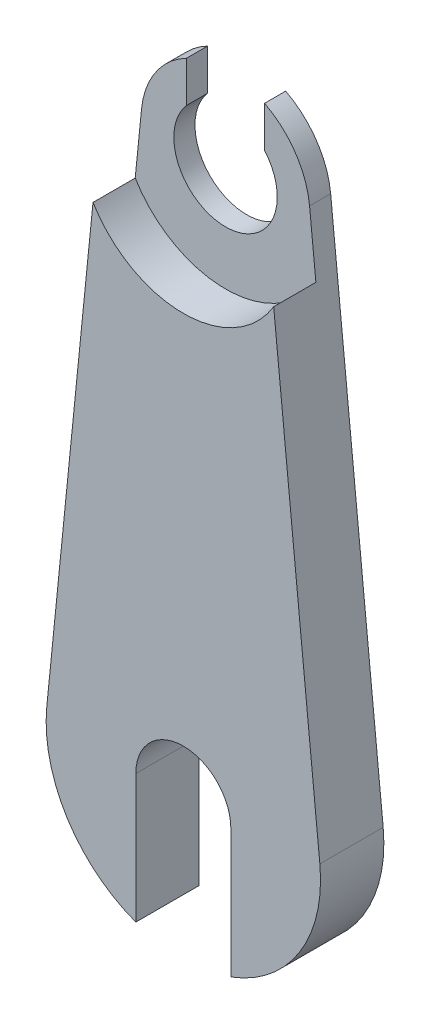
ISO-10303-21;
HEADER;
FILE_DESCRIPTION(('STEP AP214'),'2;1');
FILE_NAME('part.step','',(''),(''),'','','');
FILE_SCHEMA(('AUTOMOTIVE_DESIGN { 1 0 10303 214 1 1 1 1 }'));
ENDSEC;
DATA;
#1=APPLICATION_CONTEXT('core data for automotive mechanical design processes');
#2=APPLICATION_PROTOCOL_DEFINITION('international standard','automotive_design',2000,#1);
#3=PRODUCT_CONTEXT('',#1,'mechanical');
#4=PRODUCT('Part','Part','',(#3));
#5=PRODUCT_RELATED_PRODUCT_CATEGORY('part','',(#4));
#6=PRODUCT_DEFINITION_FORMATION('','',#4);
#7=PRODUCT_DEFINITION_CONTEXT('part definition',#1,'design');
#8=PRODUCT_DEFINITION('design','',#6,#7);
#9=PRODUCT_DEFINITION_SHAPE('','',#8);
#10=(LENGTH_UNIT() NAMED_UNIT(*) SI_UNIT(.MILLI.,.METRE.));
#11=(NAMED_UNIT(*) PLANE_ANGLE_UNIT() SI_UNIT($,.RADIAN.));
#12=(NAMED_UNIT(*) SI_UNIT($,.STERADIAN.) SOLID_ANGLE_UNIT());
#13=UNCERTAINTY_MEASURE_WITH_UNIT(LENGTH_MEASURE(1.E-05),#10,'distance_accuracy_value','');
#14=(GEOMETRIC_REPRESENTATION_CONTEXT(3) GLOBAL_UNCERTAINTY_ASSIGNED_CONTEXT((#13)) GLOBAL_UNIT_ASSIGNED_CONTEXT((#10,
#11,#12)) REPRESENTATION_CONTEXT('',''));
#15=CARTESIAN_POINT('',(0.,0.,0.));
#16=DIRECTION('',(0.,0.,1.));
#17=DIRECTION('',(1.,0.,0.));
#18=AXIS2_PLACEMENT_3D('',#15,#16,#17);
#19=CARTESIAN_POINT('',(0.,-25.,1.));
#20=DIRECTION('',(0.,0.,-1.));
#21=DIRECTION('',(-1.,0.,0.));
#22=AXIS2_PLACEMENT_3D('',#19,#20,#21);
#23=CYLINDRICAL_SURFACE('',#22,6.5);
#24=CARTESIAN_POINT('',(0.,-25.,3.));
#25=DIRECTION('',(0.,0.,1.));
#26=DIRECTION('',(1.,0.,0.));
#27=AXIS2_PLACEMENT_3D('',#24,#25,#26);
#28=CIRCLE('',#27,6.5);
#29=CARTESIAN_POINT('',(2.25000000000001,-31.0981554588252,3.));
#30=VERTEX_POINT('',#29);
#31=CARTESIAN_POINT('',(6.46741834119303,-24.35,3.));
#32=VERTEX_POINT('',#31);
#33=EDGE_CURVE('E173',#30,#32,#28,.T.);
#34=ORIENTED_EDGE('',*,*,#33,.F.);
#35=DIRECTION('',(0.,0.,-1.));
#36=VECTOR('',#35,1.);
#37=CARTESIAN_POINT('',(2.25000000000001,-31.0981554588252,1.));
#38=LINE('',#37,#36);
#39=CARTESIAN_POINT('',(2.25000000000001,-31.0981554588252,0.));
#40=VERTEX_POINT('',#39);
#41=EDGE_CURVE('E164',#30,#40,#38,.T.);
#42=ORIENTED_EDGE('',*,*,#41,.T.);
#43=CARTESIAN_POINT('',(0.,-25.,0.));
#44=DIRECTION('',(0.,0.,1.));
#45=DIRECTION('',(1.,0.,0.));
#46=AXIS2_PLACEMENT_3D('',#43,#44,#45);
#47=CIRCLE('',#46,6.5);
#48=CARTESIAN_POINT('',(6.46741834119303,-24.35,0.));
#49=VERTEX_POINT('',#48);
#50=EDGE_CURVE('E223',#40,#49,#47,.T.);
#51=ORIENTED_EDGE('',*,*,#50,.T.);
#52=DIRECTION('',(0.,0.,-1.));
#53=VECTOR('',#52,1.);
#54=CARTESIAN_POINT('',(6.46741834119303,-24.35,1.));
#55=LINE('',#54,#53);
#56=EDGE_CURVE('E230',#32,#49,#55,.T.);
#57=ORIENTED_EDGE('',*,*,#56,.F.);
#58=EDGE_LOOP('',(#34,#42,#51,#57));
#59=FACE_BOUND('',#58,.T.);
#60=ADVANCED_FACE('F35',(#59),#23,.T.);
#61=CARTESIAN_POINT('',(0.,0.,1.));
#62=DIRECTION('',(0.,0.,1.));
#63=DIRECTION('',(1.,0.,0.));
#64=AXIS2_PLACEMENT_3D('',#61,#62,#63);
#65=PLANE('',#64);
#66=CARTESIAN_POINT('',(0.,0.,1.));
#67=DIRECTION('',(0.,0.,-1.));
#68=DIRECTION('',(1.,0.,0.));
#69=AXIS2_PLACEMENT_3D('',#66,#67,#68);
#70=CIRCLE('',#69,5.);
#71=CARTESIAN_POINT('',(4.27994974842648,-2.58496231131986,1.));
#72=VERTEX_POINT('',#71);
#73=CARTESIAN_POINT('',(-4.27994974842648,-2.58496231131986,1.));
#74=VERTEX_POINT('',#73);
#75=EDGE_CURVE('E58',#72,#74,#70,.T.);
#76=ORIENTED_EDGE('',*,*,#75,.F.);
#77=DIRECTION('',(-0.1,0.99498743710662,0.));
#78=VECTOR('',#77,1.);
#79=CARTESIAN_POINT('',(3.97994974842648,0.400000000000001,1.));
#80=LINE('',#79,#78);
#81=CARTESIAN_POINT('',(3.97994974842648,0.400000000000001,1.));
#82=VERTEX_POINT('',#81);
#83=EDGE_CURVE('E215',#72,#82,#80,.T.);
#84=ORIENTED_EDGE('',*,*,#83,.T.);
#85=CARTESIAN_POINT('',(0.,0.,1.));
#86=DIRECTION('',(0.,0.,1.));
#87=DIRECTION('',(1.,0.,0.));
#88=AXIS2_PLACEMENT_3D('',#85,#86,#87);
#89=CIRCLE('',#88,4.);
#90=CARTESIAN_POINT('',(1.85,3.54647712526107,1.));
#91=VERTEX_POINT('',#90);
#92=EDGE_CURVE('E209',#82,#91,#89,.T.);
#93=ORIENTED_EDGE('',*,*,#92,.T.);
#94=DIRECTION('',(0.,1.,0.));
#95=VECTOR('',#94,1.);
#96=CARTESIAN_POINT('',(1.85,0.,1.));
#97=LINE('',#96,#95);
#98=CARTESIAN_POINT('',(1.85,1.6062378404209,1.));
#99=VERTEX_POINT('',#98);
#100=EDGE_CURVE('E191',#99,#91,#97,.T.);
#101=ORIENTED_EDGE('',*,*,#100,.F.);
#102=CARTESIAN_POINT('',(0.,0.,1.));
#103=DIRECTION('',(0.,0.,1.));
#104=DIRECTION('',(1.,0.,0.));
#105=AXIS2_PLACEMENT_3D('',#102,#103,#104);
#106=CIRCLE('',#105,2.45);
#107=CARTESIAN_POINT('',(-1.85,1.6062378404209,1.));
#108=VERTEX_POINT('',#107);
#109=EDGE_CURVE('E203',#108,#99,#106,.T.);
#110=ORIENTED_EDGE('',*,*,#109,.F.);
#111=DIRECTION('',(0.,-1.,0.));
#112=VECTOR('',#111,1.);
#113=CARTESIAN_POINT('',(-1.85,0.,1.));
#114=LINE('',#113,#112);
#115=CARTESIAN_POINT('',(-1.85,3.54647712526107,1.));
#116=VERTEX_POINT('',#115);
#117=EDGE_CURVE('E186',#116,#108,#114,.T.);
#118=ORIENTED_EDGE('',*,*,#117,.F.);
#119=CARTESIAN_POINT('',(-3.97994974842648,0.399999999999999,1.));
#120=VERTEX_POINT('',#119);
#121=EDGE_CURVE('E213',#116,#120,#89,.T.);
#122=ORIENTED_EDGE('',*,*,#121,.T.);
#123=DIRECTION('',(-0.0999999999999999,-0.99498743710662,0.));
#124=VECTOR('',#123,1.);
#125=CARTESIAN_POINT('',(-3.97994974842648,0.399999999999999,1.));
#126=LINE('',#125,#124);
#127=EDGE_CURVE('E212',#120,#74,#126,.T.);
#128=ORIENTED_EDGE('',*,*,#127,.T.);
#129=EDGE_LOOP('',(#76,#84,#93,#101,#110,#118,#122,#128));
#130=FACE_BOUND('',#129,.T.);
#131=ADVANCED_FACE('F254',(#130),#65,.T.);
#132=CARTESIAN_POINT('',(0.,0.,1.));
#133=DIRECTION('',(0.,0.,-1.));
#134=DIRECTION('',(-1.,0.,0.));
#135=AXIS2_PLACEMENT_3D('',#132,#133,#134);
#136=CYLINDRICAL_SURFACE('',#135,4.);
#137=ORIENTED_EDGE('',*,*,#121,.F.);
#138=DIRECTION('',(0.,0.,-1.));
#139=VECTOR('',#138,1.);
#140=CARTESIAN_POINT('',(-1.85,3.54647712526107,1.));
#141=LINE('',#140,#139);
#142=CARTESIAN_POINT('',(-1.85,3.54647712526107,0.));
#143=VERTEX_POINT('',#142);
#144=EDGE_CURVE('E199',#116,#143,#141,.T.);
#145=ORIENTED_EDGE('',*,*,#144,.T.);
#146=CARTESIAN_POINT('',(0.,0.,0.));
#147=DIRECTION('',(0.,0.,1.));
#148=DIRECTION('',(1.,0.,0.));
#149=AXIS2_PLACEMENT_3D('',#146,#147,#148);
#150=CIRCLE('',#149,4.);
#151=CARTESIAN_POINT('',(-3.97994974842648,0.399999999999999,0.));
#152=VERTEX_POINT('',#151);
#153=EDGE_CURVE('E206',#143,#152,#150,.T.);
#154=ORIENTED_EDGE('',*,*,#153,.T.);
#155=DIRECTION('',(0.,0.,-1.));
#156=VECTOR('',#155,1.);
#157=CARTESIAN_POINT('',(-3.97994974842648,0.399999999999999,1.));
#158=LINE('',#157,#156);
#159=EDGE_CURVE('E236',#120,#152,#158,.T.);
#160=ORIENTED_EDGE('',*,*,#159,.F.);
#161=EDGE_LOOP('',(#137,#145,#154,#160));
#162=FACE_BOUND('',#161,.T.);
#163=ADVANCED_FACE('F281',(#162),#136,.T.);
#164=CARTESIAN_POINT('',(0.,0.,0.));
#165=DIRECTION('',(0.,0.,1.));
#166=DIRECTION('',(1.,0.,0.));
#167=AXIS2_PLACEMENT_3D('',#164,#165,#166);
#168=PLANE('',#167);
#169=ORIENTED_EDGE('',*,*,#50,.F.);
#170=DIRECTION('',(0.,1.,0.));
#171=VECTOR('',#170,1.);
#172=CARTESIAN_POINT('',(2.25,-25.,0.));
#173=LINE('',#172,#171);
#174=CARTESIAN_POINT('',(2.25,-25.,0.));
#175=VERTEX_POINT('',#174);
#176=EDGE_CURVE('E143',#40,#175,#173,.T.);
#177=ORIENTED_EDGE('',*,*,#176,.T.);
#178=CARTESIAN_POINT('',(0.,-25.,0.));
#179=DIRECTION('',(0.,0.,1.));
#180=DIRECTION('',(1.,0.,0.));
#181=AXIS2_PLACEMENT_3D('',#178,#179,#180);
#182=CIRCLE('',#181,2.25);
#183=CARTESIAN_POINT('',(-2.25,-25.,0.));
#184=VERTEX_POINT('',#183);
#185=EDGE_CURVE('E138',#175,#184,#182,.T.);
#186=ORIENTED_EDGE('',*,*,#185,.T.);
#187=DIRECTION('',(0.,-1.,0.));
#188=VECTOR('',#187,1.);
#189=CARTESIAN_POINT('',(-2.25,-25.,0.));
#190=LINE('',#189,#188);
#191=CARTESIAN_POINT('',(-2.25,-31.0981554588252,0.));
#192=VERTEX_POINT('',#191);
#193=EDGE_CURVE('E146',#184,#192,#190,.T.);
#194=ORIENTED_EDGE('',*,*,#193,.T.);
#195=CARTESIAN_POINT('',(-6.46741834119303,-24.35,0.));
#196=VERTEX_POINT('',#195);
#197=EDGE_CURVE('E224',#196,#192,#47,.T.);
#198=ORIENTED_EDGE('',*,*,#197,.F.);
#199=DIRECTION('',(-0.0999999999999999,-0.99498743710662,0.));
#200=VECTOR('',#199,1.);
#201=CARTESIAN_POINT('',(-3.97994974842648,0.399999999999999,0.));
#202=LINE('',#201,#200);
#203=EDGE_CURVE('E221',#152,#196,#202,.T.);
#204=ORIENTED_EDGE('',*,*,#203,.F.);
#205=ORIENTED_EDGE('',*,*,#153,.F.);
#206=DIRECTION('',(0.,-1.,0.));
#207=VECTOR('',#206,1.);
#208=CARTESIAN_POINT('',(-1.85,0.,0.));
#209=LINE('',#208,#207);
#210=CARTESIAN_POINT('',(-1.85,1.6062378404209,0.));
#211=VERTEX_POINT('',#210);
#212=EDGE_CURVE('E187',#143,#211,#209,.T.);
#213=ORIENTED_EDGE('',*,*,#212,.T.);
#214=CARTESIAN_POINT('',(0.,0.,0.));
#215=DIRECTION('',(0.,0.,1.));
#216=DIRECTION('',(1.,0.,0.));
#217=AXIS2_PLACEMENT_3D('',#214,#215,#216);
#218=CIRCLE('',#217,2.45);
#219=CARTESIAN_POINT('',(1.85,1.6062378404209,0.));
#220=VERTEX_POINT('',#219);
#221=EDGE_CURVE('E202',#211,#220,#218,.T.);
#222=ORIENTED_EDGE('',*,*,#221,.T.);
#223=DIRECTION('',(0.,1.,0.));
#224=VECTOR('',#223,1.);
#225=CARTESIAN_POINT('',(1.85,0.,0.));
#226=LINE('',#225,#224);
#227=CARTESIAN_POINT('',(1.85,3.54647712526107,0.));
#228=VERTEX_POINT('',#227);
#229=EDGE_CURVE('E190',#220,#228,#226,.T.);
#230=ORIENTED_EDGE('',*,*,#229,.T.);
#231=CARTESIAN_POINT('',(3.97994974842648,0.400000000000001,0.));
#232=VERTEX_POINT('',#231);
#233=EDGE_CURVE('E218',#232,#228,#150,.T.);
#234=ORIENTED_EDGE('',*,*,#233,.F.);
#235=DIRECTION('',(-0.1,0.99498743710662,0.));
#236=VECTOR('',#235,1.);
#237=CARTESIAN_POINT('',(3.97994974842648,0.400000000000001,0.));
#238=LINE('',#237,#236);
#239=EDGE_CURVE('E226',#49,#232,#238,.T.);
#240=ORIENTED_EDGE('',*,*,#239,.F.);
#241=EDGE_LOOP('',(#169,#177,#186,#194,#198,#204,#205,#213,#222,#230,#234,#240));
#242=FACE_BOUND('',#241,.T.);
#243=ADVANCED_FACE('F155',(#242),#168,.F.);
#244=ORIENTED_EDGE('',*,*,#233,.T.);
#245=DIRECTION('',(0.,0.,-1.));
#246=VECTOR('',#245,1.);
#247=CARTESIAN_POINT('',(1.85,3.54647712526107,1.));
#248=LINE('',#247,#246);
#249=EDGE_CURVE('E194',#228,#91,#248,.F.);
#250=ORIENTED_EDGE('',*,*,#249,.T.);
#251=ORIENTED_EDGE('',*,*,#92,.F.);
#252=DIRECTION('',(0.,0.,-1.));
#253=VECTOR('',#252,1.);
#254=CARTESIAN_POINT('',(3.97994974842648,0.400000000000001,1.));
#255=LINE('',#254,#253);
#256=EDGE_CURVE('E217',#82,#232,#255,.T.);
#257=ORIENTED_EDGE('',*,*,#256,.T.);
#258=EDGE_LOOP('',(#244,#250,#251,#257));
#259=FACE_BOUND('',#258,.T.);
#260=ADVANCED_FACE('F37',(#259),#136,.T.);
#261=CARTESIAN_POINT('',(-3.97994974842648,0.399999999999999,1.));
#262=DIRECTION('',(0.99498743710662,-0.0999999999999999,0.));
#263=DIRECTION('',(0.0999999999999999,0.99498743710662,0.));
#264=AXIS2_PLACEMENT_3D('',#261,#262,#263);
#265=PLANE('',#264);
#266=ORIENTED_EDGE('',*,*,#203,.T.);
#267=DIRECTION('',(0.,0.,-1.));
#268=VECTOR('',#267,1.);
#269=CARTESIAN_POINT('',(-6.46741834119303,-24.35,1.));
#270=LINE('',#269,#268);
#271=CARTESIAN_POINT('',(-6.46741834119303,-24.35,3.));
#272=VERTEX_POINT('',#271);
#273=EDGE_CURVE('E233',#272,#196,#270,.T.);
#274=ORIENTED_EDGE('',*,*,#273,.F.);
#275=DIRECTION('',(-0.0999999999999999,-0.99498743710662,0.));
#276=VECTOR('',#275,1.);
#277=CARTESIAN_POINT('',(-4.27994974842648,-2.58496231131986,3.));
#278=LINE('',#277,#276);
#279=CARTESIAN_POINT('',(-4.27994974842648,-2.58496231131986,3.));
#280=VERTEX_POINT('',#279);
#281=EDGE_CURVE('E170',#280,#272,#278,.T.);
#282=ORIENTED_EDGE('',*,*,#281,.F.);
#283=DIRECTION('',(0.,0.,-1.));
#284=VECTOR('',#283,1.);
#285=CARTESIAN_POINT('',(-4.27994974842648,-2.58496231131986,3.));
#286=LINE('',#285,#284);
#287=EDGE_CURVE('E183',#280,#74,#286,.T.);
#288=ORIENTED_EDGE('',*,*,#287,.T.);
#289=ORIENTED_EDGE('',*,*,#127,.F.);
#290=ORIENTED_EDGE('',*,*,#159,.T.);
#291=EDGE_LOOP('',(#266,#274,#282,#288,#289,#290));
#292=FACE_BOUND('',#291,.T.);
#293=ADVANCED_FACE('F278',(#292),#265,.F.);
#294=ORIENTED_EDGE('',*,*,#197,.T.);
#295=DIRECTION('',(0.,0.,-1.));
#296=VECTOR('',#295,1.);
#297=CARTESIAN_POINT('',(-2.25,-31.0981554588252,1.));
#298=LINE('',#297,#296);
#299=CARTESIAN_POINT('',(-2.25,-31.0981554588252,3.));
#300=VERTEX_POINT('',#299);
#301=EDGE_CURVE('E149',#192,#300,#298,.F.);
#302=ORIENTED_EDGE('',*,*,#301,.T.);
#303=EDGE_CURVE('E174',#272,#300,#28,.T.);
#304=ORIENTED_EDGE('',*,*,#303,.F.);
#305=ORIENTED_EDGE('',*,*,#273,.T.);
#306=EDGE_LOOP('',(#294,#302,#304,#305));
#307=FACE_BOUND('',#306,.T.);
#308=ADVANCED_FACE('F274',(#307),#23,.T.);
#309=CARTESIAN_POINT('',(3.97994974842648,0.400000000000001,1.));
#310=DIRECTION('',(-0.99498743710662,-0.1,0.));
#311=DIRECTION('',(0.1,-0.99498743710662,0.));
#312=AXIS2_PLACEMENT_3D('',#309,#310,#311);
#313=PLANE('',#312);
#314=ORIENTED_EDGE('',*,*,#239,.T.);
#315=ORIENTED_EDGE('',*,*,#256,.F.);
#316=ORIENTED_EDGE('',*,*,#83,.F.);
#317=DIRECTION('',(0.,0.,-1.));
#318=VECTOR('',#317,1.);
#319=CARTESIAN_POINT('',(4.27994974842648,-2.58496231131986,3.));
#320=LINE('',#319,#318);
#321=CARTESIAN_POINT('',(4.27994974842648,-2.58496231131986,3.));
#322=VERTEX_POINT('',#321);
#323=EDGE_CURVE('E179',#322,#72,#320,.T.);
#324=ORIENTED_EDGE('',*,*,#323,.F.);
#325=DIRECTION('',(-0.1,0.99498743710662,0.));
#326=VECTOR('',#325,1.);
#327=CARTESIAN_POINT('',(6.46741834119303,-24.35,3.));
#328=LINE('',#327,#326);
#329=EDGE_CURVE('E177',#32,#322,#328,.T.);
#330=ORIENTED_EDGE('',*,*,#329,.F.);
#331=ORIENTED_EDGE('',*,*,#56,.T.);
#332=EDGE_LOOP('',(#314,#315,#316,#324,#330,#331));
#333=FACE_BOUND('',#332,.T.);
#334=ADVANCED_FACE('F261',(#333),#313,.F.);
#335=CARTESIAN_POINT('',(0.,0.,1.));
#336=DIRECTION('',(0.,0.,-1.));
#337=DIRECTION('',(-1.,0.,0.));
#338=AXIS2_PLACEMENT_3D('',#335,#336,#337);
#339=CYLINDRICAL_SURFACE('',#338,2.45);
#340=DIRECTION('',(0.,0.,-1.));
#341=VECTOR('',#340,1.);
#342=CARTESIAN_POINT('',(-1.85,1.6062378404209,1.));
#343=LINE('',#342,#341);
#344=EDGE_CURVE('E43',#108,#211,#343,.T.);
#345=ORIENTED_EDGE('',*,*,#344,.F.);
#346=ORIENTED_EDGE('',*,*,#109,.T.);
#347=DIRECTION('',(0.,0.,-1.));
#348=VECTOR('',#347,1.);
#349=CARTESIAN_POINT('',(1.85,1.6062378404209,1.));
#350=LINE('',#349,#348);
#351=EDGE_CURVE('E239',#220,#99,#350,.F.);
#352=ORIENTED_EDGE('',*,*,#351,.F.);
#353=ORIENTED_EDGE('',*,*,#221,.F.);
#354=EDGE_LOOP('',(#345,#346,#352,#353));
#355=FACE_BOUND('',#354,.T.);
#356=ADVANCED_FACE('F250',(#355),#339,.F.);
#357=CARTESIAN_POINT('',(1.85,0.,0.));
#358=DIRECTION('',(1.,0.,0.));
#359=DIRECTION('',(0.,0.,-1.));
#360=AXIS2_PLACEMENT_3D('',#357,#358,#359);
#361=PLANE('',#360);
#362=ORIENTED_EDGE('',*,*,#229,.F.);
#363=ORIENTED_EDGE('',*,*,#351,.T.);
#364=ORIENTED_EDGE('',*,*,#100,.T.);
#365=ORIENTED_EDGE('',*,*,#249,.F.);
#366=EDGE_LOOP('',(#362,#363,#364,#365));
#367=FACE_BOUND('',#366,.T.);
#368=ADVANCED_FACE('F253',(#367),#361,.F.);
#369=CARTESIAN_POINT('',(-1.85,0.,0.));
#370=DIRECTION('',(-1.,0.,0.));
#371=DIRECTION('',(0.,-1.,0.));
#372=AXIS2_PLACEMENT_3D('',#369,#370,#371);
#373=PLANE('',#372);
#374=ORIENTED_EDGE('',*,*,#117,.T.);
#375=ORIENTED_EDGE('',*,*,#344,.T.);
#376=ORIENTED_EDGE('',*,*,#212,.F.);
#377=ORIENTED_EDGE('',*,*,#144,.F.);
#378=EDGE_LOOP('',(#374,#375,#376,#377));
#379=FACE_BOUND('',#378,.T.);
#380=ADVANCED_FACE('F242',(#379),#373,.F.);
#381=CARTESIAN_POINT('',(0.,0.,3.));
#382=DIRECTION('',(0.,0.,-1.));
#383=DIRECTION('',(-1.,0.,0.));
#384=AXIS2_PLACEMENT_3D('',#381,#382,#383);
#385=CYLINDRICAL_SURFACE('',#384,5.);
#386=ORIENTED_EDGE('',*,*,#75,.T.);
#387=ORIENTED_EDGE('',*,*,#287,.F.);
#388=CARTESIAN_POINT('',(0.,0.,3.));
#389=DIRECTION('',(0.,0.,-1.));
#390=DIRECTION('',(1.,0.,0.));
#391=AXIS2_PLACEMENT_3D('',#388,#389,#390);
#392=CIRCLE('',#391,5.);
#393=EDGE_CURVE('E167',#322,#280,#392,.T.);
#394=ORIENTED_EDGE('',*,*,#393,.F.);
#395=ORIENTED_EDGE('',*,*,#323,.T.);
#396=EDGE_LOOP('',(#386,#387,#394,#395));
#397=FACE_BOUND('',#396,.T.);
#398=ADVANCED_FACE('F285',(#397),#385,.F.);
#399=CARTESIAN_POINT('',(0.,0.,3.));
#400=DIRECTION('',(0.,0.,1.));
#401=DIRECTION('',(1.,0.,0.));
#402=AXIS2_PLACEMENT_3D('',#399,#400,#401);
#403=PLANE('',#402);
#404=DIRECTION('',(0.,1.,0.));
#405=VECTOR('',#404,1.);
#406=CARTESIAN_POINT('',(2.24999999999998,0.,3.));
#407=LINE('',#406,#405);
#408=CARTESIAN_POINT('',(2.25,-25.,3.));
#409=VERTEX_POINT('',#408);
#410=EDGE_CURVE('E11',#30,#409,#407,.T.);
#411=ORIENTED_EDGE('',*,*,#410,.F.);
#412=ORIENTED_EDGE('',*,*,#33,.T.);
#413=ORIENTED_EDGE('',*,*,#329,.T.);
#414=ORIENTED_EDGE('',*,*,#393,.T.);
#415=ORIENTED_EDGE('',*,*,#281,.T.);
#416=ORIENTED_EDGE('',*,*,#303,.T.);
#417=DIRECTION('',(0.,-1.,0.));
#418=VECTOR('',#417,1.);
#419=CARTESIAN_POINT('',(-2.25,-25.,3.));
#420=LINE('',#419,#418);
#421=CARTESIAN_POINT('',(-2.25,-25.,3.));
#422=VERTEX_POINT('',#421);
#423=EDGE_CURVE('E156',#422,#300,#420,.T.);
#424=ORIENTED_EDGE('',*,*,#423,.F.);
#425=CARTESIAN_POINT('',(0.,-25.,3.));
#426=DIRECTION('',(0.,0.,1.));
#427=DIRECTION('',(1.,0.,0.));
#428=AXIS2_PLACEMENT_3D('',#425,#426,#427);
#429=CIRCLE('',#428,2.25);
#430=EDGE_CURVE('E50',#409,#422,#429,.T.);
#431=ORIENTED_EDGE('',*,*,#430,.F.);
#432=EDGE_LOOP('',(#411,#412,#413,#414,#415,#416,#424,#431));
#433=FACE_BOUND('',#432,.T.);
#434=ADVANCED_FACE('F271',(#433),#403,.T.);
#435=CARTESIAN_POINT('',(2.25,-25.,0.));
#436=DIRECTION('',(1.,0.,0.));
#437=DIRECTION('',(0.,1.,0.));
#438=AXIS2_PLACEMENT_3D('',#435,#436,#437);
#439=PLANE('',#438);
#440=ORIENTED_EDGE('',*,*,#410,.T.);
#441=DIRECTION('',(0.,0.,1.));
#442=VECTOR('',#441,1.);
#443=CARTESIAN_POINT('',(2.25,-25.,0.));
#444=LINE('',#443,#442);
#445=EDGE_CURVE('E142',#175,#409,#444,.T.);
#446=ORIENTED_EDGE('',*,*,#445,.F.);
#447=ORIENTED_EDGE('',*,*,#176,.F.);
#448=ORIENTED_EDGE('',*,*,#41,.F.);
#449=EDGE_LOOP('',(#440,#446,#447,#448));
#450=FACE_BOUND('',#449,.T.);
#451=ADVANCED_FACE('F269',(#450),#439,.F.);
#452=CARTESIAN_POINT('',(-2.25,-25.,0.));
#453=DIRECTION('',(-1.,0.,0.));
#454=DIRECTION('',(0.,0.,1.));
#455=AXIS2_PLACEMENT_3D('',#452,#453,#454);
#456=PLANE('',#455);
#457=ORIENTED_EDGE('',*,*,#193,.F.);
#458=DIRECTION('',(0.,0.,1.));
#459=VECTOR('',#458,1.);
#460=CARTESIAN_POINT('',(-2.25,-25.,0.));
#461=LINE('',#460,#459);
#462=EDGE_CURVE('E134',#184,#422,#461,.T.);
#463=ORIENTED_EDGE('',*,*,#462,.T.);
#464=ORIENTED_EDGE('',*,*,#423,.T.);
#465=ORIENTED_EDGE('',*,*,#301,.F.);
#466=EDGE_LOOP('',(#457,#463,#464,#465));
#467=FACE_BOUND('',#466,.T.);
#468=ADVANCED_FACE('F147',(#467),#456,.F.);
#469=CARTESIAN_POINT('',(0.,-25.,0.));
#470=DIRECTION('',(0.,0.,1.));
#471=DIRECTION('',(1.,0.,0.));
#472=AXIS2_PLACEMENT_3D('',#469,#470,#471);
#473=CYLINDRICAL_SURFACE('',#472,2.25);
#474=ORIENTED_EDGE('',*,*,#430,.T.);
#475=ORIENTED_EDGE('',*,*,#462,.F.);
#476=ORIENTED_EDGE('',*,*,#185,.F.);
#477=ORIENTED_EDGE('',*,*,#445,.T.);
#478=EDGE_LOOP('',(#474,#475,#476,#477));
#479=FACE_BOUND('',#478,.T.);
#480=ADVANCED_FACE('F136',(#479),#473,.F.);
#481=CLOSED_SHELL('',(#60,#131,#163,#243,#260,#293,#308,#334,#356,#368,#380,#398,#434,#451,#468,#480));
#482=MANIFOLD_SOLID_BREP('B2',#481);
#483=ADVANCED_BREP_SHAPE_REPRESENTATION('',(#18,#482),#14);
#484=SHAPE_DEFINITION_REPRESENTATION(#9,#483);
ENDSEC;
END-ISO-10303-21;
